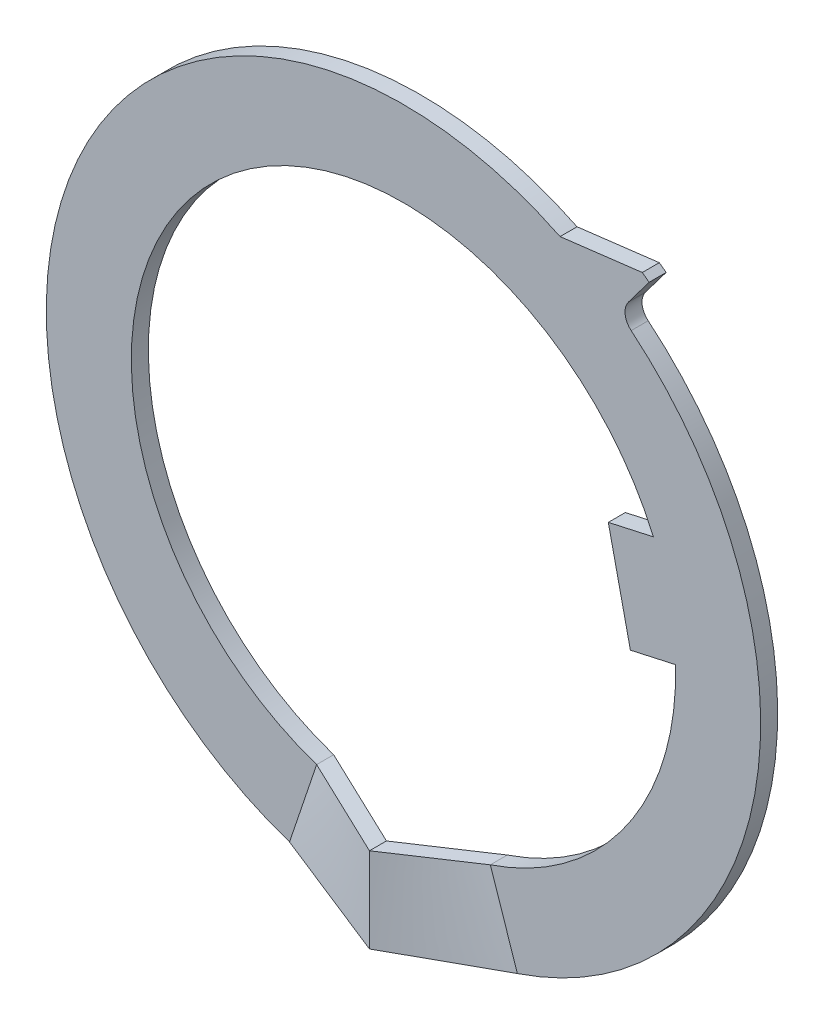
ISO-10303-21;
HEADER;
FILE_DESCRIPTION(('STEP AP214'),'2;1');
FILE_NAME('part.step','',(''),(''),'','','');
FILE_SCHEMA(('AUTOMOTIVE_DESIGN { 1 0 10303 214 1 1 1 1 }'));
ENDSEC;
DATA;
#1=APPLICATION_CONTEXT('core data for automotive mechanical design processes');
#2=APPLICATION_PROTOCOL_DEFINITION('international standard','automotive_design',2000,#1);
#3=PRODUCT_CONTEXT('',#1,'mechanical');
#4=PRODUCT('Part','Part','',(#3));
#5=PRODUCT_RELATED_PRODUCT_CATEGORY('part','',(#4));
#6=PRODUCT_DEFINITION_FORMATION('','',#4);
#7=PRODUCT_DEFINITION_CONTEXT('part definition',#1,'design');
#8=PRODUCT_DEFINITION('design','',#6,#7);
#9=PRODUCT_DEFINITION_SHAPE('','',#8);
#10=(LENGTH_UNIT() NAMED_UNIT(*) SI_UNIT(.MILLI.,.METRE.));
#11=(NAMED_UNIT(*) PLANE_ANGLE_UNIT() SI_UNIT($,.RADIAN.));
#12=(NAMED_UNIT(*) SI_UNIT($,.STERADIAN.) SOLID_ANGLE_UNIT());
#13=UNCERTAINTY_MEASURE_WITH_UNIT(LENGTH_MEASURE(1.E-05),#10,'distance_accuracy_value','');
#14=(GEOMETRIC_REPRESENTATION_CONTEXT(3) GLOBAL_UNCERTAINTY_ASSIGNED_CONTEXT((#13)) GLOBAL_UNIT_ASSIGNED_CONTEXT((#10,
#11,#12)) REPRESENTATION_CONTEXT('',''));
#15=CARTESIAN_POINT('',(0.,0.,0.));
#16=DIRECTION('',(0.,0.,1.));
#17=DIRECTION('',(1.,0.,0.));
#18=AXIS2_PLACEMENT_3D('',#15,#16,#17);
#19=CARTESIAN_POINT('',(0.,0.,-0.5));
#20=DIRECTION('',(0.,0.,1.));
#21=DIRECTION('',(1.,0.,0.));
#22=AXIS2_PLACEMENT_3D('',#19,#20,#21);
#23=CYLINDRICAL_SURFACE('',#22,10.5);
#24=CARTESIAN_POINT('',(0.,0.,-0.5));
#25=DIRECTION('',(0.,0.,1.));
#26=DIRECTION('',(1.,0.,0.));
#27=AXIS2_PLACEMENT_3D('',#24,#25,#26);
#28=CIRCLE('',#27,10.5);
#29=CARTESIAN_POINT('',(3.35,-9.95125620210835,-0.5));
#30=VERTEX_POINT('',#29);
#31=CARTESIAN_POINT('',(6.6936933634957,8.08977559364249,-0.5));
#32=VERTEX_POINT('',#31);
#33=EDGE_CURVE('E182',#30,#32,#28,.T.);
#34=ORIENTED_EDGE('',*,*,#33,.T.);
#35=DIRECTION('',(0.,0.,1.));
#36=VECTOR('',#35,1.);
#37=CARTESIAN_POINT('',(6.6936933634957,8.08977559364249,-0.5));
#38=LINE('',#37,#36);
#39=CARTESIAN_POINT('',(6.6936933634957,8.08977559364249,0.));
#40=VERTEX_POINT('',#39);
#41=EDGE_CURVE('E228',#32,#40,#38,.T.);
#42=ORIENTED_EDGE('',*,*,#41,.T.);
#43=CARTESIAN_POINT('',(0.,0.,0.));
#44=DIRECTION('',(0.,0.,1.));
#45=DIRECTION('',(1.,0.,0.));
#46=AXIS2_PLACEMENT_3D('',#43,#44,#45);
#47=CIRCLE('',#46,10.5);
#48=CARTESIAN_POINT('',(3.35,-9.95125620210835,0.));
#49=VERTEX_POINT('',#48);
#50=EDGE_CURVE('E184',#49,#40,#47,.T.);
#51=ORIENTED_EDGE('',*,*,#50,.F.);
#52=DIRECTION('',(0.,0.,-1.));
#53=VECTOR('',#52,1.);
#54=CARTESIAN_POINT('',(3.35,-9.95125620210835,0.));
#55=LINE('',#54,#53);
#56=EDGE_CURVE('E158',#49,#30,#55,.T.);
#57=ORIENTED_EDGE('',*,*,#56,.T.);
#58=EDGE_LOOP('',(#34,#42,#51,#57));
#59=FACE_BOUND('',#58,.T.);
#60=ADVANCED_FACE('F47',(#59),#23,.T.);
#61=CARTESIAN_POINT('',(4.60289704128531,9.43733748614125,-0.5));
#62=VERTEX_POINT('',#61);
#63=CARTESIAN_POINT('',(-3.35,-9.95125620210835,-0.5));
#64=VERTEX_POINT('',#63);
#65=EDGE_CURVE('E190',#62,#64,#28,.T.);
#66=ORIENTED_EDGE('',*,*,#65,.T.);
#67=DIRECTION('',(0.,0.,1.));
#68=VECTOR('',#67,1.);
#69=CARTESIAN_POINT('',(-3.35,-9.95125620210835,0.));
#70=LINE('',#69,#68);
#71=CARTESIAN_POINT('',(-3.35,-9.95125620210835,0.));
#72=VERTEX_POINT('',#71);
#73=EDGE_CURVE('E232',#72,#64,#70,.F.);
#74=ORIENTED_EDGE('',*,*,#73,.F.);
#75=CARTESIAN_POINT('',(4.60289704128531,9.43733748614125,0.));
#76=VERTEX_POINT('',#75);
#77=EDGE_CURVE('E210',#76,#72,#47,.T.);
#78=ORIENTED_EDGE('',*,*,#77,.F.);
#79=DIRECTION('',(0.,0.,1.));
#80=VECTOR('',#79,1.);
#81=CARTESIAN_POINT('',(4.60289704128531,9.43733748614125,-0.5));
#82=LINE('',#81,#80);
#83=EDGE_CURVE('E216',#62,#76,#82,.T.);
#84=ORIENTED_EDGE('',*,*,#83,.F.);
#85=EDGE_LOOP('',(#66,#74,#78,#84));
#86=FACE_BOUND('',#85,.T.);
#87=ADVANCED_FACE('F455',(#86),#23,.T.);
#88=CARTESIAN_POINT('',(0.,0.,-0.5));
#89=DIRECTION('',(0.,0.,1.));
#90=DIRECTION('',(1.,0.,0.));
#91=AXIS2_PLACEMENT_3D('',#88,#89,#90);
#92=PLANE('',#91);
#93=DIRECTION('',(-0.319047619047619,0.947738685915081,0.));
#94=VECTOR('',#93,1.);
#95=CARTESIAN_POINT('',(2.55238095238095,-7.58190948732065,-0.5));
#96=LINE('',#95,#94);
#97=CARTESIAN_POINT('',(2.55238095238095,-7.58190948732065,-0.5));
#98=VERTEX_POINT('',#97);
#99=EDGE_CURVE('E169',#30,#98,#96,.T.);
#100=ORIENTED_EDGE('',*,*,#99,.T.);
#101=CARTESIAN_POINT('',(0.,0.,-0.5));
#102=DIRECTION('',(0.,0.,1.));
#103=DIRECTION('',(1.,0.,0.));
#104=AXIS2_PLACEMENT_3D('',#101,#102,#103);
#105=CIRCLE('',#104,8.);
#106=CARTESIAN_POINT('',(7.99650749844079,0.236363760716841,-0.5));
#107=VERTEX_POINT('',#106);
#108=EDGE_CURVE('E288',#98,#107,#105,.T.);
#109=ORIENTED_EDGE('',*,*,#108,.T.);
#110=DIRECTION('',(0.976296007119932,0.216439613938107,0.));
#111=VECTOR('',#110,1.);
#112=CARTESIAN_POINT('',(6.67058346718672,-0.0575865200822017,-0.5));
#113=LINE('',#112,#111);
#114=CARTESIAN_POINT('',(6.67058346718672,-0.0575865200822017,-0.5));
#115=VERTEX_POINT('',#114);
#116=EDGE_CURVE('E276',#115,#107,#113,.T.);
#117=ORIENTED_EDGE('',*,*,#116,.F.);
#118=DIRECTION('',(0.216439613938107,-0.976296007119932,0.));
#119=VECTOR('',#118,1.);
#120=CARTESIAN_POINT('',(6.0212646253724,2.8713015012776,-0.5));
#121=LINE('',#120,#119);
#122=CARTESIAN_POINT('',(6.0212646253724,2.8713015012776,-0.5));
#123=VERTEX_POINT('',#122);
#124=EDGE_CURVE('E272',#123,#115,#121,.T.);
#125=ORIENTED_EDGE('',*,*,#124,.F.);
#126=DIRECTION('',(-0.976296007119932,-0.216439613938107,0.));
#127=VECTOR('',#126,1.);
#128=CARTESIAN_POINT('',(6.0212646253724,2.8713015012776,-0.5));
#129=LINE('',#128,#127);
#130=CARTESIAN_POINT('',(7.34718865662647,3.16525178207664,-0.5));
#131=VERTEX_POINT('',#130);
#132=EDGE_CURVE('E270',#131,#123,#129,.T.);
#133=ORIENTED_EDGE('',*,*,#132,.F.);
#134=CARTESIAN_POINT('',(-2.55238095238095,-7.58190948732065,-0.499999999999999));
#135=VERTEX_POINT('',#134);
#136=EDGE_CURVE('E211',#131,#135,#105,.T.);
#137=ORIENTED_EDGE('',*,*,#136,.T.);
#138=DIRECTION('',(-0.319047619047619,-0.947738685915082,0.));
#139=VECTOR('',#138,1.);
#140=CARTESIAN_POINT('',(-2.55238095238095,-7.58190948732065,-0.5));
#141=LINE('',#140,#139);
#142=EDGE_CURVE('E175',#135,#64,#141,.T.);
#143=ORIENTED_EDGE('',*,*,#142,.T.);
#144=ORIENTED_EDGE('',*,*,#65,.F.);
#145=DIRECTION('',(-0.992655061391107,-0.120979044030846,0.));
#146=VECTOR('',#145,1.);
#147=CARTESIAN_POINT('',(4.60289704128531,9.43733748614125,-0.5));
#148=LINE('',#147,#146);
#149=CARTESIAN_POINT('',(7.0205686729772,9.73198928832185,-0.5));
#150=VERTEX_POINT('',#149);
#151=EDGE_CURVE('E205',#150,#62,#148,.T.);
#152=ORIENTED_EDGE('',*,*,#151,.F.);
#153=CARTESIAN_POINT('',(0.,0.,-0.5));
#154=DIRECTION('',(0.,0.,1.));
#155=DIRECTION('',(1.,0.,0.));
#156=AXIS2_PLACEMENT_3D('',#153,#154,#155);
#157=CIRCLE('',#156,12.);
#158=CARTESIAN_POINT('',(7.22178027782459,9.58362612056751,-0.5));
#159=VERTEX_POINT('',#158);
#160=EDGE_CURVE('E202',#159,#150,#157,.T.);
#161=ORIENTED_EDGE('',*,*,#160,.F.);
#162=DIRECTION('',(0.601815023152048,0.798635510047293,0.));
#163=VECTOR('',#162,1.);
#164=CARTESIAN_POINT('',(6.31905774309651,8.38567285549657,-0.5));
#165=LINE('',#164,#163);
#166=CARTESIAN_POINT('',(6.61312291149565,8.77591051443959,-0.5));
#167=VERTEX_POINT('',#166);
#168=EDGE_CURVE('E193',#167,#159,#165,.T.);
#169=ORIENTED_EDGE('',*,*,#168,.F.);
#170=CARTESIAN_POINT('',(7.0124406665193,8.47500300286356,-0.5));
#171=DIRECTION('',(0.,0.,1.));
#172=DIRECTION('',(1.,0.,0.));
#173=AXIS2_PLACEMENT_3D('',#170,#171,#172);
#174=CIRCLE('',#173,0.5);
#175=EDGE_CURVE('E12',#167,#32,#174,.T.);
#176=ORIENTED_EDGE('',*,*,#175,.T.);
#177=ORIENTED_EDGE('',*,*,#33,.F.);
#178=EDGE_LOOP('',(#100,#109,#117,#125,#133,#137,#143,#144,#152,#161,#169,#176,#177));
#179=FACE_BOUND('',#178,.T.);
#180=ADVANCED_FACE('F188',(#179),#92,.F.);
#181=CARTESIAN_POINT('',(0.,0.,0.));
#182=DIRECTION('',(0.,0.,1.));
#183=DIRECTION('',(1.,0.,0.));
#184=AXIS2_PLACEMENT_3D('',#181,#182,#183);
#185=PLANE('',#184);
#186=CARTESIAN_POINT('',(0.,0.,0.));
#187=DIRECTION('',(0.,0.,1.));
#188=DIRECTION('',(1.,0.,0.));
#189=AXIS2_PLACEMENT_3D('',#186,#187,#188);
#190=CIRCLE('',#189,8.);
#191=CARTESIAN_POINT('',(2.55238095238095,-7.58190948732065,0.));
#192=VERTEX_POINT('',#191);
#193=CARTESIAN_POINT('',(7.99650749844079,0.236363760716841,0.));
#194=VERTEX_POINT('',#193);
#195=EDGE_CURVE('E199',#192,#194,#190,.T.);
#196=ORIENTED_EDGE('',*,*,#195,.F.);
#197=DIRECTION('',(-0.319047619047619,0.947738685915081,0.));
#198=VECTOR('',#197,1.);
#199=CARTESIAN_POINT('',(2.55238095238095,-7.58190948732065,0.));
#200=LINE('',#199,#198);
#201=EDGE_CURVE('E231',#49,#192,#200,.T.);
#202=ORIENTED_EDGE('',*,*,#201,.F.);
#203=ORIENTED_EDGE('',*,*,#50,.T.);
#204=CARTESIAN_POINT('',(7.0124406665193,8.47500300286356,0.));
#205=DIRECTION('',(0.,0.,1.));
#206=DIRECTION('',(1.,0.,0.));
#207=AXIS2_PLACEMENT_3D('',#204,#205,#206);
#208=CIRCLE('',#207,0.5);
#209=CARTESIAN_POINT('',(6.61312291149565,8.77591051443959,0.));
#210=VERTEX_POINT('',#209);
#211=EDGE_CURVE('E55',#40,#210,#208,.F.);
#212=ORIENTED_EDGE('',*,*,#211,.T.);
#213=DIRECTION('',(0.601815023152048,0.798635510047293,0.));
#214=VECTOR('',#213,1.);
#215=CARTESIAN_POINT('',(6.31905774309651,8.38567285549657,0.));
#216=LINE('',#215,#214);
#217=CARTESIAN_POINT('',(7.22178027782459,9.58362612056751,0.));
#218=VERTEX_POINT('',#217);
#219=EDGE_CURVE('E212',#210,#218,#216,.T.);
#220=ORIENTED_EDGE('',*,*,#219,.T.);
#221=CARTESIAN_POINT('',(0.,0.,0.));
#222=DIRECTION('',(0.,0.,1.));
#223=DIRECTION('',(1.,0.,0.));
#224=AXIS2_PLACEMENT_3D('',#221,#222,#223);
#225=CIRCLE('',#224,12.);
#226=CARTESIAN_POINT('',(7.0205686729772,9.73198928832185,0.));
#227=VERTEX_POINT('',#226);
#228=EDGE_CURVE('E195',#218,#227,#225,.T.);
#229=ORIENTED_EDGE('',*,*,#228,.T.);
#230=DIRECTION('',(-0.992655061391107,-0.120979044030846,0.));
#231=VECTOR('',#230,1.);
#232=CARTESIAN_POINT('',(4.60289704128531,9.43733748614125,0.));
#233=LINE('',#232,#231);
#234=EDGE_CURVE('E191',#227,#76,#233,.T.);
#235=ORIENTED_EDGE('',*,*,#234,.T.);
#236=ORIENTED_EDGE('',*,*,#77,.T.);
#237=DIRECTION('',(0.319047619047619,0.947738685915082,0.));
#238=VECTOR('',#237,1.);
#239=CARTESIAN_POINT('',(-3.35,-9.95125620210835,0.));
#240=LINE('',#239,#238);
#241=CARTESIAN_POINT('',(-2.55238095238095,-7.58190948732065,0.));
#242=VERTEX_POINT('',#241);
#243=EDGE_CURVE('E236',#242,#72,#240,.F.);
#244=ORIENTED_EDGE('',*,*,#243,.F.);
#245=CARTESIAN_POINT('',(7.34718865662646,3.16525178207664,0.));
#246=VERTEX_POINT('',#245);
#247=EDGE_CURVE('E289',#246,#242,#190,.T.);
#248=ORIENTED_EDGE('',*,*,#247,.F.);
#249=DIRECTION('',(-0.976296007119932,-0.216439613938107,0.));
#250=VECTOR('',#249,1.);
#251=CARTESIAN_POINT('',(6.0212646253724,2.8713015012776,0.));
#252=LINE('',#251,#250);
#253=CARTESIAN_POINT('',(6.0212646253724,2.8713015012776,0.));
#254=VERTEX_POINT('',#253);
#255=EDGE_CURVE('E185',#246,#254,#252,.T.);
#256=ORIENTED_EDGE('',*,*,#255,.T.);
#257=DIRECTION('',(0.216439613938107,-0.976296007119932,0.));
#258=VECTOR('',#257,1.);
#259=CARTESIAN_POINT('',(6.0212646253724,2.8713015012776,0.));
#260=LINE('',#259,#258);
#261=CARTESIAN_POINT('',(6.67058346718672,-0.0575865200822017,0.));
#262=VERTEX_POINT('',#261);
#263=EDGE_CURVE('E281',#254,#262,#260,.T.);
#264=ORIENTED_EDGE('',*,*,#263,.T.);
#265=DIRECTION('',(0.976296007119932,0.216439613938107,0.));
#266=VECTOR('',#265,1.);
#267=CARTESIAN_POINT('',(6.67058346718672,-0.0575865200822017,0.));
#268=LINE('',#267,#266);
#269=EDGE_CURVE('E273',#262,#194,#268,.T.);
#270=ORIENTED_EDGE('',*,*,#269,.T.);
#271=EDGE_LOOP('',(#196,#202,#203,#212,#220,#229,#235,#236,#244,#248,#256,#264,#270));
#272=FACE_BOUND('',#271,.T.);
#273=ADVANCED_FACE('F262',(#272),#185,.T.);
#274=CARTESIAN_POINT('',(0.,0.,-0.5));
#275=DIRECTION('',(0.,0.,1.));
#276=DIRECTION('',(1.,0.,0.));
#277=AXIS2_PLACEMENT_3D('',#274,#275,#276);
#278=CYLINDRICAL_SURFACE('',#277,8.);
#279=DIRECTION('',(0.,0.,-1.));
#280=VECTOR('',#279,1.);
#281=CARTESIAN_POINT('',(2.55238095238095,-7.58190948732065,0.));
#282=LINE('',#281,#280);
#283=EDGE_CURVE('E186',#192,#98,#282,.T.);
#284=ORIENTED_EDGE('',*,*,#283,.F.);
#285=ORIENTED_EDGE('',*,*,#195,.T.);
#286=DIRECTION('',(0.,0.,1.));
#287=VECTOR('',#286,1.);
#288=CARTESIAN_POINT('',(7.99650749844079,0.236363760716841,-0.5));
#289=LINE('',#288,#287);
#290=EDGE_CURVE('E225',#194,#107,#289,.F.);
#291=ORIENTED_EDGE('',*,*,#290,.T.);
#292=ORIENTED_EDGE('',*,*,#108,.F.);
#293=EDGE_LOOP('',(#284,#285,#291,#292));
#294=FACE_BOUND('',#293,.T.);
#295=ADVANCED_FACE('F297',(#294),#278,.F.);
#296=DIRECTION('',(0.,0.,1.));
#297=VECTOR('',#296,1.);
#298=CARTESIAN_POINT('',(-2.55238095238095,-7.58190948732065,-0.5));
#299=LINE('',#298,#297);
#300=EDGE_CURVE('E235',#242,#135,#299,.F.);
#301=ORIENTED_EDGE('',*,*,#300,.T.);
#302=ORIENTED_EDGE('',*,*,#136,.F.);
#303=DIRECTION('',(0.,0.,1.));
#304=VECTOR('',#303,1.);
#305=CARTESIAN_POINT('',(7.34718865662647,3.16525178207664,-0.5));
#306=LINE('',#305,#304);
#307=EDGE_CURVE('E218',#131,#246,#306,.T.);
#308=ORIENTED_EDGE('',*,*,#307,.T.);
#309=ORIENTED_EDGE('',*,*,#247,.T.);
#310=EDGE_LOOP('',(#301,#302,#308,#309));
#311=FACE_BOUND('',#310,.T.);
#312=ADVANCED_FACE('F312',(#311),#278,.F.);
#313=CARTESIAN_POINT('',(4.60289704128531,9.43733748614125,-0.5));
#314=DIRECTION('',(-0.120979044030846,0.992655061391107,0.));
#315=DIRECTION('',(-0.992655061391107,-0.120979044030846,0.));
#316=AXIS2_PLACEMENT_3D('',#313,#314,#315);
#317=PLANE('',#316);
#318=ORIENTED_EDGE('',*,*,#234,.F.);
#319=DIRECTION('',(0.,0.,1.));
#320=VECTOR('',#319,1.);
#321=CARTESIAN_POINT('',(7.0205686729772,9.73198928832185,-0.5));
#322=LINE('',#321,#320);
#323=EDGE_CURVE('E219',#150,#227,#322,.T.);
#324=ORIENTED_EDGE('',*,*,#323,.F.);
#325=ORIENTED_EDGE('',*,*,#151,.T.);
#326=ORIENTED_EDGE('',*,*,#83,.T.);
#327=EDGE_LOOP('',(#318,#324,#325,#326));
#328=FACE_BOUND('',#327,.T.);
#329=ADVANCED_FACE('F442',(#328),#317,.T.);
#330=CARTESIAN_POINT('',(0.,0.,-0.5));
#331=DIRECTION('',(0.,0.,1.));
#332=DIRECTION('',(1.,0.,0.));
#333=AXIS2_PLACEMENT_3D('',#330,#331,#332);
#334=CYLINDRICAL_SURFACE('',#333,12.);
#335=ORIENTED_EDGE('',*,*,#228,.F.);
#336=DIRECTION('',(0.,0.,1.));
#337=VECTOR('',#336,1.);
#338=CARTESIAN_POINT('',(7.22178027782459,9.58362612056751,-0.5));
#339=LINE('',#338,#337);
#340=EDGE_CURVE('E208',#159,#218,#339,.T.);
#341=ORIENTED_EDGE('',*,*,#340,.F.);
#342=ORIENTED_EDGE('',*,*,#160,.T.);
#343=ORIENTED_EDGE('',*,*,#323,.T.);
#344=EDGE_LOOP('',(#335,#341,#342,#343));
#345=FACE_BOUND('',#344,.T.);
#346=ADVANCED_FACE('F447',(#345),#334,.T.);
#347=CARTESIAN_POINT('',(6.31905774309651,8.38567285549657,-0.5));
#348=DIRECTION('',(0.798635510047293,-0.601815023152048,0.));
#349=DIRECTION('',(0.601815023152048,0.798635510047293,0.));
#350=AXIS2_PLACEMENT_3D('',#347,#348,#349);
#351=PLANE('',#350);
#352=ORIENTED_EDGE('',*,*,#219,.F.);
#353=DIRECTION('',(0.,0.,-1.));
#354=VECTOR('',#353,1.);
#355=CARTESIAN_POINT('',(6.61312291149565,8.77591051443959,-0.5));
#356=LINE('',#355,#354);
#357=EDGE_CURVE('E62',#210,#167,#356,.T.);
#358=ORIENTED_EDGE('',*,*,#357,.T.);
#359=ORIENTED_EDGE('',*,*,#168,.T.);
#360=ORIENTED_EDGE('',*,*,#340,.T.);
#361=EDGE_LOOP('',(#352,#358,#359,#360));
#362=FACE_BOUND('',#361,.T.);
#363=ADVANCED_FACE('F460',(#362),#351,.T.);
#364=CARTESIAN_POINT('',(6.67058346718672,-0.0575865200822017,-0.5));
#365=DIRECTION('',(0.216439613938107,-0.976296007119932,0.));
#366=DIRECTION('',(0.976296007119932,0.216439613938107,0.));
#367=AXIS2_PLACEMENT_3D('',#364,#365,#366);
#368=PLANE('',#367);
#369=ORIENTED_EDGE('',*,*,#290,.F.);
#370=ORIENTED_EDGE('',*,*,#269,.F.);
#371=DIRECTION('',(0.,0.,1.));
#372=VECTOR('',#371,1.);
#373=CARTESIAN_POINT('',(6.67058346718672,-0.0575865200822017,-0.5));
#374=LINE('',#373,#372);
#375=EDGE_CURVE('E285',#115,#262,#374,.T.);
#376=ORIENTED_EDGE('',*,*,#375,.F.);
#377=ORIENTED_EDGE('',*,*,#116,.T.);
#378=EDGE_LOOP('',(#369,#370,#376,#377));
#379=FACE_BOUND('',#378,.T.);
#380=ADVANCED_FACE('F300',(#379),#368,.T.);
#381=CARTESIAN_POINT('',(6.0212646253724,2.8713015012776,-0.5));
#382=DIRECTION('',(-0.216439613938107,0.976296007119932,0.));
#383=DIRECTION('',(-0.976296007119932,-0.216439613938107,0.));
#384=AXIS2_PLACEMENT_3D('',#381,#382,#383);
#385=PLANE('',#384);
#386=ORIENTED_EDGE('',*,*,#307,.F.);
#387=ORIENTED_EDGE('',*,*,#132,.T.);
#388=DIRECTION('',(0.,0.,1.));
#389=VECTOR('',#388,1.);
#390=CARTESIAN_POINT('',(6.0212646253724,2.8713015012776,-0.5));
#391=LINE('',#390,#389);
#392=EDGE_CURVE('E279',#123,#254,#391,.T.);
#393=ORIENTED_EDGE('',*,*,#392,.T.);
#394=ORIENTED_EDGE('',*,*,#255,.F.);
#395=EDGE_LOOP('',(#386,#387,#393,#394));
#396=FACE_BOUND('',#395,.T.);
#397=ADVANCED_FACE('F311',(#396),#385,.T.);
#398=CARTESIAN_POINT('',(6.0212646253724,2.8713015012776,-0.5));
#399=DIRECTION('',(-0.976296007119933,-0.216439613938107,0.));
#400=DIRECTION('',(0.216439613938107,-0.976296007119932,0.));
#401=AXIS2_PLACEMENT_3D('',#398,#399,#400);
#402=PLANE('',#401);
#403=ORIENTED_EDGE('',*,*,#263,.F.);
#404=ORIENTED_EDGE('',*,*,#392,.F.);
#405=ORIENTED_EDGE('',*,*,#124,.T.);
#406=ORIENTED_EDGE('',*,*,#375,.T.);
#407=EDGE_LOOP('',(#403,#404,#405,#406));
#408=FACE_BOUND('',#407,.T.);
#409=ADVANCED_FACE('F305',(#408),#402,.T.);
#410=CARTESIAN_POINT('',(-2.55238095238095,-7.58190948732065,0.));
#411=CARTESIAN_POINT('',(0.,-8.,1.));
#412=CARTESIAN_POINT('',(-2.68531746031746,-7.97680060645193,0.));
#413=CARTESIAN_POINT('',(0.,-8.41666666666663,1.));
#414=CARTESIAN_POINT('',(-2.81825396825396,-8.37169172558321,0.));
#415=CARTESIAN_POINT('',(0.,-8.83333333333328,1.));
#416=CARTESIAN_POINT('',(-3.08412698412698,-9.16147396384578,0.));
#417=CARTESIAN_POINT('',(0.,-9.66666666666661,1.));
#418=CARTESIAN_POINT('',(-3.21706349206349,-9.55636508297707,0.));
#419=CARTESIAN_POINT('',(0.,-10.0833333333333,1.));
#420=CARTESIAN_POINT('',(-3.35,-9.95125620210835,0.));
#421=CARTESIAN_POINT('',(0.,-10.5,1.));
#422=B_SPLINE_SURFACE_WITH_KNOTS('',3,1,((#410,#411),(#412,#413),(#414,#415),(#416,#417),(#418,
#419),(#420,#421)),.UNSPECIFIED.,.F.,.F.,.F.,(4,2,4),(2,2),(0.,0.5,1.),(0.,1.),.UNSPECIFIED.);
#423=DIRECTION('',(0.946629142920687,-0.155061752561556,0.282575863558414));
#424=VECTOR('',#423,1.);
#425=CARTESIAN_POINT('',(-1.675,-10.2256281010542,0.5));
#426=LINE('',#425,#424);
#427=CARTESIAN_POINT('',(0.,-10.5,1.));
#428=VERTEX_POINT('',#427);
#429=EDGE_CURVE('E325',#72,#428,#426,.T.);
#430=DIRECTION('',(0.,-1.,0.));
#431=VECTOR('',#430,1.);
#432=CARTESIAN_POINT('',(0.,-8.,1.));
#433=LINE('',#432,#431);
#434=CARTESIAN_POINT('',(0.,-8.,1.));
#435=VERTEX_POINT('',#434);
#436=EDGE_CURVE('E255',#435,#428,#433,.T.);
#437=DIRECTION('',(-0.920445135939133,0.150772704371981,-0.36062216146869));
#438=VECTOR('',#437,1.);
#439=CARTESIAN_POINT('',(-1.27619047619048,-7.79095474366032,0.5));
#440=LINE('',#439,#438);
#441=EDGE_CURVE('E318',#435,#242,#440,.T.);
#442=ORIENTED_EDGE('',*,*,#243,.T.);
#443=ORIENTED_EDGE('',*,*,#429,.T.);
#444=ORIENTED_EDGE('',*,*,#436,.F.);
#445=ORIENTED_EDGE('',*,*,#441,.T.);
#446=EDGE_LOOP('',(#442,#443,#444,#445));
#447=FACE_BOUND('',#446,.T.);
#448=ADVANCED_FACE('F321',(#447),#422,.T.);
#449=CARTESIAN_POINT('',(-1.675,-10.2256281010542,0.));
#450=DIRECTION('',(0.161649797532998,0.986848186377996,0.));
#451=DIRECTION('',(-0.986848186377996,0.161649797532998,0.));
#452=AXIS2_PLACEMENT_3D('',#449,#450,#451);
#453=PLANE('',#452);
#454=DIRECTION('',(0.946629142920687,-0.155061752561556,0.282575863558414));
#455=VECTOR('',#454,1.);
#456=CARTESIAN_POINT('',(-3.35,-9.95125620210835,-0.5));
#457=LINE('',#456,#455);
#458=CARTESIAN_POINT('',(0.,-10.5,0.5));
#459=VERTEX_POINT('',#458);
#460=EDGE_CURVE('E328',#64,#459,#457,.T.);
#461=ORIENTED_EDGE('',*,*,#460,.T.);
#462=DIRECTION('',(0.,0.,-1.));
#463=VECTOR('',#462,1.);
#464=CARTESIAN_POINT('',(0.,-10.5,1.));
#465=LINE('',#464,#463);
#466=EDGE_CURVE('E160',#428,#459,#465,.T.);
#467=ORIENTED_EDGE('',*,*,#466,.F.);
#468=ORIENTED_EDGE('',*,*,#429,.F.);
#469=ORIENTED_EDGE('',*,*,#73,.T.);
#470=EDGE_LOOP('',(#461,#467,#468,#469));
#471=FACE_BOUND('',#470,.T.);
#472=ADVANCED_FACE('F352',(#471),#453,.F.);
#473=CARTESIAN_POINT('',(-1.2761904761905,-7.79095474366032,0.));
#474=DIRECTION('',(-0.161649797533001,-0.986848186377996,0.));
#475=DIRECTION('',(0.986848186377996,-0.161649797533001,0.));
#476=AXIS2_PLACEMENT_3D('',#473,#474,#475);
#477=PLANE('',#476);
#478=ORIENTED_EDGE('',*,*,#441,.F.);
#479=DIRECTION('',(0.,0.,1.));
#480=VECTOR('',#479,1.);
#481=CARTESIAN_POINT('',(0.,-8.,1.));
#482=LINE('',#481,#480);
#483=CARTESIAN_POINT('',(0.,-8.,0.5));
#484=VERTEX_POINT('',#483);
#485=EDGE_CURVE('E176',#484,#435,#482,.T.);
#486=ORIENTED_EDGE('',*,*,#485,.F.);
#487=DIRECTION('',(0.920445135939133,-0.150772704371981,0.36062216146869));
#488=VECTOR('',#487,1.);
#489=CARTESIAN_POINT('',(-1.27619047619048,-7.79095474366033,0.));
#490=LINE('',#489,#488);
#491=EDGE_CURVE('E258',#135,#484,#490,.T.);
#492=ORIENTED_EDGE('',*,*,#491,.F.);
#493=ORIENTED_EDGE('',*,*,#300,.F.);
#494=EDGE_LOOP('',(#478,#486,#492,#493));
#495=FACE_BOUND('',#494,.T.);
#496=ADVANCED_FACE('F316',(#495),#477,.F.);
#497=CARTESIAN_POINT('',(-3.35,-9.95125620210835,-0.5));
#498=CARTESIAN_POINT('',(0.,-10.5,0.5));
#499=CARTESIAN_POINT('',(-3.21706349206349,-9.55636508297706,-0.5));
#500=CARTESIAN_POINT('',(0.,-10.0833333333333,0.5));
#501=CARTESIAN_POINT('',(-3.08412698412698,-9.16147396384577,-0.5));
#502=CARTESIAN_POINT('',(0.,-9.66666666666667,0.5));
#503=CARTESIAN_POINT('',(-2.81825396825396,-8.3716917255832,-0.5));
#504=CARTESIAN_POINT('',(0.,-8.83333333333334,0.5));
#505=CARTESIAN_POINT('',(-2.68531746031746,-7.97680060645193,-0.5));
#506=CARTESIAN_POINT('',(0.,-8.41666666666667,0.5));
#507=CARTESIAN_POINT('',(-2.55238095238095,-7.58190948732065,-0.5));
#508=CARTESIAN_POINT('',(0.,-8.,0.5));
#509=B_SPLINE_SURFACE_WITH_KNOTS('',3,1,((#497,#498),(#499,#500),(#501,#502),(#503,#504),(#505,
#506),(#507,#508)),.UNSPECIFIED.,.F.,.F.,.F.,(4,2,4),(2,2),(0.,0.5,1.),(0.,1.),.UNSPECIFIED.);
#510=DIRECTION('',(0.,1.,0.));
#511=VECTOR('',#510,1.);
#512=CARTESIAN_POINT('',(0.,-8.,0.5));
#513=LINE('',#512,#511);
#514=EDGE_CURVE('E243',#459,#484,#513,.T.);
#515=ORIENTED_EDGE('',*,*,#142,.F.);
#516=ORIENTED_EDGE('',*,*,#491,.T.);
#517=ORIENTED_EDGE('',*,*,#514,.F.);
#518=ORIENTED_EDGE('',*,*,#460,.F.);
#519=EDGE_LOOP('',(#515,#516,#517,#518));
#520=FACE_BOUND('',#519,.T.);
#521=ADVANCED_FACE('F351',(#520),#509,.T.);
#522=CARTESIAN_POINT('',(1.675,-10.2256281010542,0.));
#523=DIRECTION('',(-0.161649797532998,0.986848186377996,0.));
#524=DIRECTION('',(0.986848186377996,0.161649797532998,0.));
#525=AXIS2_PLACEMENT_3D('',#522,#523,#524);
#526=PLANE('',#525);
#527=DIRECTION('',(-0.946629142920687,-0.155061752561556,0.282575863558414));
#528=VECTOR('',#527,1.);
#529=CARTESIAN_POINT('',(3.35,-9.95125620210835,-0.5));
#530=LINE('',#529,#528);
#531=EDGE_CURVE('E153',#30,#459,#530,.T.);
#532=ORIENTED_EDGE('',*,*,#531,.F.);
#533=ORIENTED_EDGE('',*,*,#56,.F.);
#534=DIRECTION('',(-0.946629142920687,-0.155061752561556,0.282575863558414));
#535=VECTOR('',#534,1.);
#536=CARTESIAN_POINT('',(1.675,-10.2256281010542,0.5));
#537=LINE('',#536,#535);
#538=EDGE_CURVE('E326',#49,#428,#537,.T.);
#539=ORIENTED_EDGE('',*,*,#538,.T.);
#540=ORIENTED_EDGE('',*,*,#466,.T.);
#541=EDGE_LOOP('',(#532,#533,#539,#540));
#542=FACE_BOUND('',#541,.T.);
#543=ADVANCED_FACE('F155',(#542),#526,.F.);
#544=CARTESIAN_POINT('',(2.55238095238095,-7.58190948732065,0.));
#545=CARTESIAN_POINT('',(0.,-8.,1.));
#546=CARTESIAN_POINT('',(2.68531746031746,-7.97680060645193,0.));
#547=CARTESIAN_POINT('',(0.,-8.41666666666663,1.));
#548=CARTESIAN_POINT('',(2.81825396825396,-8.37169172558321,0.));
#549=CARTESIAN_POINT('',(0.,-8.83333333333328,1.));
#550=CARTESIAN_POINT('',(3.08412698412698,-9.16147396384578,0.));
#551=CARTESIAN_POINT('',(0.,-9.66666666666661,1.));
#552=CARTESIAN_POINT('',(3.21706349206349,-9.55636508297707,0.));
#553=CARTESIAN_POINT('',(0.,-10.0833333333333,1.));
#554=CARTESIAN_POINT('',(3.35,-9.95125620210835,0.));
#555=CARTESIAN_POINT('',(0.,-10.5,1.));
#556=B_SPLINE_SURFACE_WITH_KNOTS('',3,1,((#544,#545),(#546,#547),(#548,#549),(#550,#551),(#552,
#553),(#554,#555)),.UNSPECIFIED.,.F.,.F.,.F.,(4,2,4),(2,2),(0.,0.5,1.),(0.,1.),.UNSPECIFIED.);
#557=DIRECTION('',(0.920445135939133,0.150772704371981,-0.36062216146869));
#558=VECTOR('',#557,1.);
#559=CARTESIAN_POINT('',(1.27619047619048,-7.79095474366032,0.5));
#560=LINE('',#559,#558);
#561=EDGE_CURVE('E164',#435,#192,#560,.T.);
#562=ORIENTED_EDGE('',*,*,#201,.T.);
#563=ORIENTED_EDGE('',*,*,#561,.F.);
#564=ORIENTED_EDGE('',*,*,#436,.T.);
#565=ORIENTED_EDGE('',*,*,#538,.F.);
#566=EDGE_LOOP('',(#562,#563,#564,#565));
#567=FACE_BOUND('',#566,.T.);
#568=ADVANCED_FACE('F407',(#567),#556,.F.);
#569=CARTESIAN_POINT('',(1.2761904761905,-7.79095474366032,0.));
#570=DIRECTION('',(0.161649797533001,-0.986848186377996,0.));
#571=DIRECTION('',(-0.986848186377996,-0.161649797533001,0.));
#572=AXIS2_PLACEMENT_3D('',#569,#570,#571);
#573=PLANE('',#572);
#574=ORIENTED_EDGE('',*,*,#561,.T.);
#575=ORIENTED_EDGE('',*,*,#283,.T.);
#576=DIRECTION('',(-0.920445135939133,-0.150772704371981,0.36062216146869));
#577=VECTOR('',#576,1.);
#578=CARTESIAN_POINT('',(1.27619047619048,-7.79095474366033,0.));
#579=LINE('',#578,#577);
#580=EDGE_CURVE('E165',#98,#484,#579,.T.);
#581=ORIENTED_EDGE('',*,*,#580,.T.);
#582=ORIENTED_EDGE('',*,*,#485,.T.);
#583=EDGE_LOOP('',(#574,#575,#581,#582));
#584=FACE_BOUND('',#583,.T.);
#585=ADVANCED_FACE('F452',(#584),#573,.F.);
#586=CARTESIAN_POINT('',(3.35,-9.95125620210835,-0.5));
#587=CARTESIAN_POINT('',(0.,-10.5,0.5));
#588=CARTESIAN_POINT('',(3.21706349206349,-9.55636508297706,-0.5));
#589=CARTESIAN_POINT('',(0.,-10.0833333333333,0.5));
#590=CARTESIAN_POINT('',(3.08412698412698,-9.16147396384577,-0.5));
#591=CARTESIAN_POINT('',(0.,-9.66666666666667,0.5));
#592=CARTESIAN_POINT('',(2.81825396825396,-8.3716917255832,-0.5));
#593=CARTESIAN_POINT('',(0.,-8.83333333333334,0.5));
#594=CARTESIAN_POINT('',(2.68531746031746,-7.97680060645193,-0.5));
#595=CARTESIAN_POINT('',(0.,-8.41666666666667,0.5));
#596=CARTESIAN_POINT('',(2.55238095238095,-7.58190948732065,-0.5));
#597=CARTESIAN_POINT('',(0.,-8.,0.5));
#598=B_SPLINE_SURFACE_WITH_KNOTS('',3,1,((#586,#587),(#588,#589),(#590,#591),(#592,#593),(#594,
#595),(#596,#597)),.UNSPECIFIED.,.F.,.F.,.F.,(4,2,4),(2,2),(0.,0.5,1.),(0.,1.),.UNSPECIFIED.);
#599=ORIENTED_EDGE('',*,*,#99,.F.);
#600=ORIENTED_EDGE('',*,*,#531,.T.);
#601=ORIENTED_EDGE('',*,*,#514,.T.);
#602=ORIENTED_EDGE('',*,*,#580,.F.);
#603=EDGE_LOOP('',(#599,#600,#601,#602));
#604=FACE_BOUND('',#603,.T.);
#605=ADVANCED_FACE('F170',(#604),#598,.F.);
#606=CARTESIAN_POINT('',(7.0124406665193,8.47500300286356,-0.5));
#607=DIRECTION('',(0.,0.,1.));
#608=DIRECTION('',(1.,0.,0.));
#609=AXIS2_PLACEMENT_3D('',#606,#607,#608);
#610=CYLINDRICAL_SURFACE('',#609,0.5);
#611=ORIENTED_EDGE('',*,*,#175,.F.);
#612=ORIENTED_EDGE('',*,*,#357,.F.);
#613=ORIENTED_EDGE('',*,*,#211,.F.);
#614=ORIENTED_EDGE('',*,*,#41,.F.);
#615=EDGE_LOOP('',(#611,#612,#613,#614));
#616=FACE_BOUND('',#615,.T.);
#617=ADVANCED_FACE('F49',(#616),#610,.F.);
#618=CLOSED_SHELL('',(#60,#87,#180,#273,#295,#312,#329,#346,#363,#380,#397,#409,#448,#472,#496,
#521,#543,#568,#585,#605,#617));
#619=MANIFOLD_SOLID_BREP('B2',#618);
#620=ADVANCED_BREP_SHAPE_REPRESENTATION('',(#18,#619),#14);
#621=SHAPE_DEFINITION_REPRESENTATION(#9,#620);
ENDSEC;
END-ISO-10303-21;
